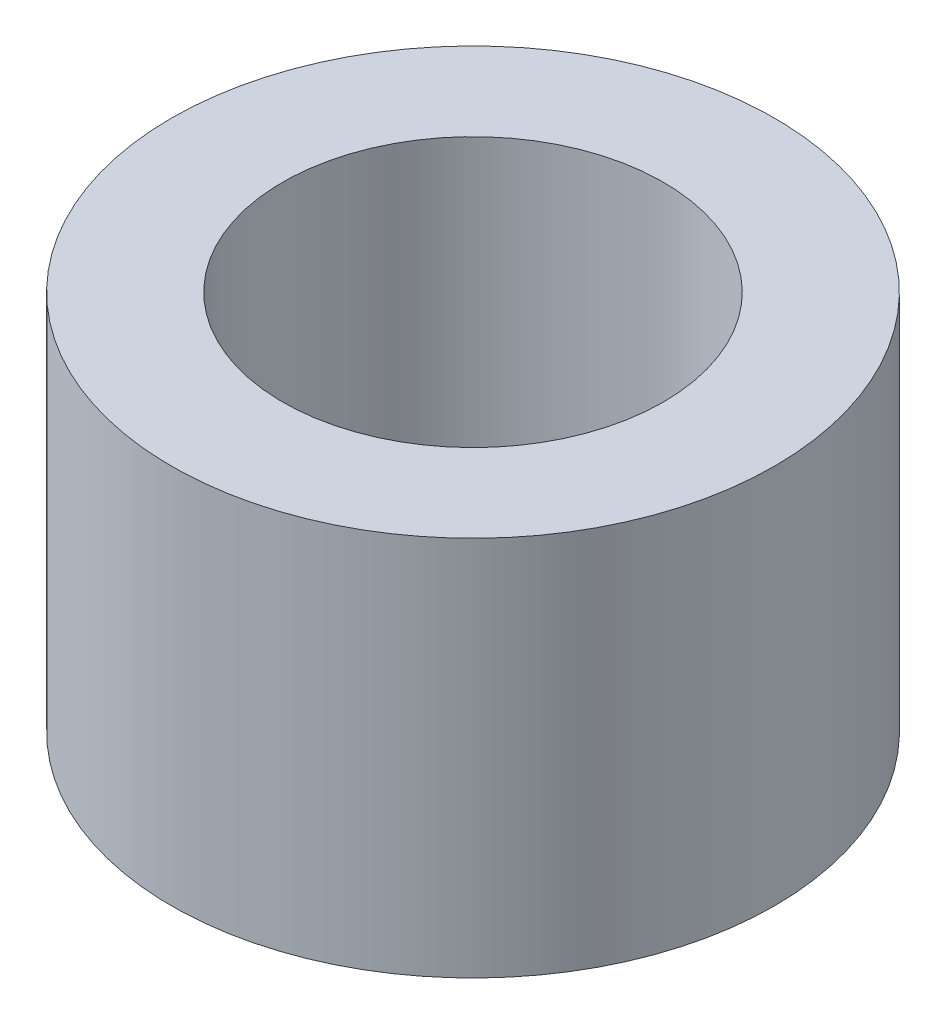
ISO-10303-21;
HEADER;
FILE_DESCRIPTION(('STEP AP214'),'2;1');
FILE_NAME('part.step','',(''),(''),'','','');
FILE_SCHEMA(('AUTOMOTIVE_DESIGN { 1 0 10303 214 1 1 1 1 }'));
ENDSEC;
DATA;
#1=APPLICATION_CONTEXT('core data for automotive mechanical design processes');
#2=APPLICATION_PROTOCOL_DEFINITION('international standard','automotive_design',2000,#1);
#3=PRODUCT_CONTEXT('',#1,'mechanical');
#4=PRODUCT('Part','Part','',(#3));
#5=PRODUCT_RELATED_PRODUCT_CATEGORY('part','',(#4));
#6=PRODUCT_DEFINITION_FORMATION('','',#4);
#7=PRODUCT_DEFINITION_CONTEXT('part definition',#1,'design');
#8=PRODUCT_DEFINITION('design','',#6,#7);
#9=PRODUCT_DEFINITION_SHAPE('','',#8);
#10=(LENGTH_UNIT() NAMED_UNIT(*) SI_UNIT(.MILLI.,.METRE.));
#11=(NAMED_UNIT(*) PLANE_ANGLE_UNIT() SI_UNIT($,.RADIAN.));
#12=(NAMED_UNIT(*) SI_UNIT($,.STERADIAN.) SOLID_ANGLE_UNIT());
#13=UNCERTAINTY_MEASURE_WITH_UNIT(LENGTH_MEASURE(1.E-05),#10,'distance_accuracy_value','');
#14=(GEOMETRIC_REPRESENTATION_CONTEXT(3) GLOBAL_UNCERTAINTY_ASSIGNED_CONTEXT((#13)) GLOBAL_UNIT_ASSIGNED_CONTEXT((#10,
#11,#12)) REPRESENTATION_CONTEXT('',''));
#15=CARTESIAN_POINT('',(0.,0.,0.));
#16=DIRECTION('',(0.,0.,1.));
#17=DIRECTION('',(1.,0.,0.));
#18=AXIS2_PLACEMENT_3D('',#15,#16,#17);
#19=CARTESIAN_POINT('',(0.,10.4,0.));
#20=DIRECTION('',(0.,1.,0.));
#21=DIRECTION('',(1.,0.,0.));
#22=AXIS2_PLACEMENT_3D('',#19,#20,#21);
#23=PLANE('',#22);
#24=CARTESIAN_POINT('',(0.,10.4,0.));
#25=DIRECTION('',(0.,1.,0.));
#26=DIRECTION('',(-1.,0.,0.));
#27=AXIS2_PLACEMENT_3D('',#24,#25,#26);
#28=CIRCLE('',#27,3.);
#29=CARTESIAN_POINT('',(3.,10.4,0.));
#30=VERTEX_POINT('',#29);
#31=EDGE_CURVE('E62',#30,#30,#28,.T.);
#32=ORIENTED_EDGE('',*,*,#31,.T.);
#33=EDGE_LOOP('',(#32));
#34=FACE_BOUND('',#33,.T.);
#35=CARTESIAN_POINT('',(0.,10.4,0.));
#36=DIRECTION('',(0.,-1.,0.));
#37=DIRECTION('',(-1.,0.,0.));
#38=AXIS2_PLACEMENT_3D('',#35,#36,#37);
#39=CIRCLE('',#38,4.75);
#40=CARTESIAN_POINT('',(4.75,10.4,0.));
#41=VERTEX_POINT('',#40);
#42=EDGE_CURVE('E74',#41,#41,#39,.T.);
#43=ORIENTED_EDGE('',*,*,#42,.T.);
#44=EDGE_LOOP('',(#43));
#45=FACE_BOUND('',#44,.T.);
#46=ADVANCED_FACE('F19',(#34,#45),#23,.F.);
#47=CARTESIAN_POINT('',(0.,16.4,0.));
#48=DIRECTION('',(0.,1.,0.));
#49=DIRECTION('',(1.,0.,0.));
#50=AXIS2_PLACEMENT_3D('',#47,#48,#49);
#51=PLANE('',#50);
#52=CARTESIAN_POINT('',(0.,16.4,0.));
#53=DIRECTION('',(0.,-1.,0.));
#54=DIRECTION('',(-1.,0.,0.));
#55=AXIS2_PLACEMENT_3D('',#52,#53,#54);
#56=CIRCLE('',#55,3.);
#57=CARTESIAN_POINT('',(3.,16.4,0.));
#58=VERTEX_POINT('',#57);
#59=EDGE_CURVE('E23',#58,#58,#56,.T.);
#60=ORIENTED_EDGE('',*,*,#59,.T.);
#61=EDGE_LOOP('',(#60));
#62=FACE_BOUND('',#61,.T.);
#63=CARTESIAN_POINT('',(0.,16.4,0.));
#64=DIRECTION('',(0.,1.,0.));
#65=DIRECTION('',(-1.,0.,0.));
#66=AXIS2_PLACEMENT_3D('',#63,#64,#65);
#67=CIRCLE('',#66,4.75);
#68=CARTESIAN_POINT('',(4.75,16.4,0.));
#69=VERTEX_POINT('',#68);
#70=EDGE_CURVE('E11',#69,#69,#67,.T.);
#71=ORIENTED_EDGE('',*,*,#70,.T.);
#72=EDGE_LOOP('',(#71));
#73=FACE_BOUND('',#72,.T.);
#74=ADVANCED_FACE('F82',(#62,#73),#51,.T.);
#75=CARTESIAN_POINT('',(0.,16.4,0.));
#76=DIRECTION('',(0.,-1.,0.));
#77=DIRECTION('',(-1.,0.,0.));
#78=AXIS2_PLACEMENT_3D('',#75,#76,#77);
#79=CYLINDRICAL_SURFACE('',#78,4.75);
#80=ORIENTED_EDGE('',*,*,#42,.F.);
#81=DIRECTION('',(0.,1.,0.));
#82=VECTOR('',#81,1.);
#83=CARTESIAN_POINT('',(4.75,16.4,0.));
#84=LINE('',#83,#82);
#85=EDGE_CURVE('E29',#41,#69,#84,.T.);
#86=ORIENTED_EDGE('',*,*,#85,.T.);
#87=ORIENTED_EDGE('',*,*,#70,.F.);
#88=ORIENTED_EDGE('',*,*,#85,.F.);
#89=EDGE_LOOP('',(#80,#86,#87,#88));
#90=FACE_BOUND('',#89,.T.);
#91=ADVANCED_FACE('F21',(#90),#79,.T.);
#92=CARTESIAN_POINT('',(0.,16.4,0.));
#93=DIRECTION('',(0.,-1.,0.));
#94=DIRECTION('',(-1.,0.,0.));
#95=AXIS2_PLACEMENT_3D('',#92,#93,#94);
#96=CYLINDRICAL_SURFACE('',#95,3.);
#97=ORIENTED_EDGE('',*,*,#31,.F.);
#98=DIRECTION('',(0.,1.,0.));
#99=VECTOR('',#98,1.);
#100=CARTESIAN_POINT('',(3.,16.4,0.));
#101=LINE('',#100,#99);
#102=EDGE_CURVE('E59',#30,#58,#101,.T.);
#103=ORIENTED_EDGE('',*,*,#102,.T.);
#104=ORIENTED_EDGE('',*,*,#59,.F.);
#105=ORIENTED_EDGE('',*,*,#102,.F.);
#106=EDGE_LOOP('',(#97,#103,#104,#105));
#107=FACE_BOUND('',#106,.T.);
#108=ADVANCED_FACE('F61',(#107),#96,.F.);
#109=CLOSED_SHELL('',(#46,#74,#91,#108));
#110=MANIFOLD_SOLID_BREP('B1',#109);
#111=ADVANCED_BREP_SHAPE_REPRESENTATION('',(#18,#110),#14);
#112=SHAPE_DEFINITION_REPRESENTATION(#9,#111);
ENDSEC;
END-ISO-10303-21;
